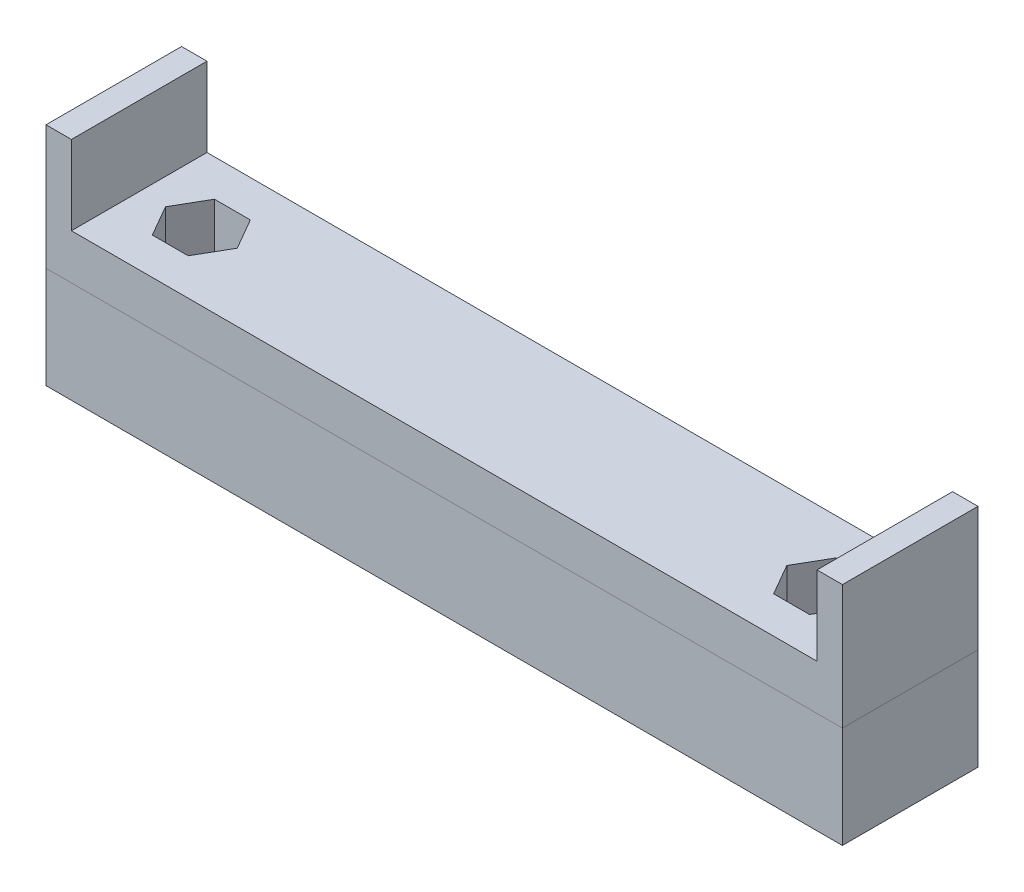
ISO-10303-21;
HEADER;
FILE_DESCRIPTION(('STEP AP214'),'2;1');
FILE_NAME('part.step','',(''),(''),'','','');
FILE_SCHEMA(('AUTOMOTIVE_DESIGN { 1 0 10303 214 1 1 1 1 }'));
ENDSEC;
DATA;
#1=APPLICATION_CONTEXT('core data for automotive mechanical design processes');
#2=APPLICATION_PROTOCOL_DEFINITION('international standard','automotive_design',2000,#1);
#3=PRODUCT_CONTEXT('',#1,'mechanical');
#4=PRODUCT('Part','Part','',(#3));
#5=PRODUCT_RELATED_PRODUCT_CATEGORY('part','',(#4));
#6=PRODUCT_DEFINITION_FORMATION('','',#4);
#7=PRODUCT_DEFINITION_CONTEXT('part definition',#1,'design');
#8=PRODUCT_DEFINITION('design','',#6,#7);
#9=PRODUCT_DEFINITION_SHAPE('','',#8);
#10=(LENGTH_UNIT() NAMED_UNIT(*) SI_UNIT(.MILLI.,.METRE.));
#11=(NAMED_UNIT(*) PLANE_ANGLE_UNIT() SI_UNIT($,.RADIAN.));
#12=(NAMED_UNIT(*) SI_UNIT($,.STERADIAN.) SOLID_ANGLE_UNIT());
#13=UNCERTAINTY_MEASURE_WITH_UNIT(LENGTH_MEASURE(1.E-05),#10,'distance_accuracy_value','');
#14=(GEOMETRIC_REPRESENTATION_CONTEXT(3) GLOBAL_UNCERTAINTY_ASSIGNED_CONTEXT((#13)) GLOBAL_UNIT_ASSIGNED_CONTEXT((#10,
#11,#12)) REPRESENTATION_CONTEXT('',''));
#15=CARTESIAN_POINT('',(0.,0.,0.));
#16=DIRECTION('',(0.,0.,1.));
#17=DIRECTION('',(1.,0.,0.));
#18=AXIS2_PLACEMENT_3D('',#15,#16,#17);
#19=CARTESIAN_POINT('',(0.,3.,0.));
#20=DIRECTION('',(0.,1.,0.));
#21=DIRECTION('',(0.,0.,1.));
#22=AXIS2_PLACEMENT_3D('',#19,#20,#21);
#23=PLANE('',#22);
#24=DIRECTION('',(0.,0.,-1.));
#25=VECTOR('',#24,1.);
#26=CARTESIAN_POINT('',(11.8285330862955,3.,15.7136970191991));
#27=LINE('',#26,#25);
#28=CARTESIAN_POINT('',(11.8285330862955,3.,15.7136970191991));
#29=VERTEX_POINT('',#28);
#30=CARTESIAN_POINT('',(11.8285330862955,3.,3.71369701919913));
#31=VERTEX_POINT('',#30);
#32=EDGE_CURVE('E315',#29,#31,#27,.T.);
#33=ORIENTED_EDGE('',*,*,#32,.F.);
#34=DIRECTION('',(1.,0.,0.));
#35=VECTOR('',#34,1.);
#36=CARTESIAN_POINT('',(12.3285330862955,3.,15.7136970191991));
#37=LINE('',#36,#35);
#38=CARTESIAN_POINT('',(77.8285330862955,3.,15.7136970191991));
#39=VERTEX_POINT('',#38);
#40=EDGE_CURVE('E46',#29,#39,#37,.T.);
#41=ORIENTED_EDGE('',*,*,#40,.T.);
#42=DIRECTION('',(0.,0.,1.));
#43=VECTOR('',#42,1.);
#44=CARTESIAN_POINT('',(77.8285330862955,3.,3.71369701919913));
#45=LINE('',#44,#43);
#46=CARTESIAN_POINT('',(77.8285330862955,3.,3.71369701919913));
#47=VERTEX_POINT('',#46);
#48=EDGE_CURVE('E328',#47,#39,#45,.T.);
#49=ORIENTED_EDGE('',*,*,#48,.F.);
#50=DIRECTION('',(-1.,0.,0.));
#51=VECTOR('',#50,1.);
#52=CARTESIAN_POINT('',(12.3285330862955,3.,3.71369701919913));
#53=LINE('',#52,#51);
#54=EDGE_CURVE('E11',#47,#31,#53,.T.);
#55=ORIENTED_EDGE('',*,*,#54,.T.);
#56=EDGE_LOOP('',(#33,#41,#49,#55));
#57=FACE_BOUND('',#56,.T.);
#58=DIRECTION('',(0.5,0.,-0.866025403784439));
#59=VECTOR('',#58,1.);
#60=CARTESIAN_POINT('',(18.9162463265669,3.,12.4636970191991));
#61=LINE('',#60,#59);
#62=CARTESIAN_POINT('',(18.9162463265669,3.,12.4636970191991));
#63=VERTEX_POINT('',#62);
#64=CARTESIAN_POINT('',(20.5039595668384,3.,9.71369701919912));
#65=VERTEX_POINT('',#64);
#66=EDGE_CURVE('E62',#63,#65,#61,.T.);
#67=ORIENTED_EDGE('',*,*,#66,.F.);
#68=DIRECTION('',(1.,0.,0.));
#69=VECTOR('',#68,1.);
#70=CARTESIAN_POINT('',(15.740819846024,3.,12.4636970191991));
#71=LINE('',#70,#69);
#72=CARTESIAN_POINT('',(15.740819846024,3.,12.4636970191991));
#73=VERTEX_POINT('',#72);
#74=EDGE_CURVE('E208',#73,#63,#71,.T.);
#75=ORIENTED_EDGE('',*,*,#74,.F.);
#76=DIRECTION('',(0.5,0.,0.866025403784438));
#77=VECTOR('',#76,1.);
#78=CARTESIAN_POINT('',(14.1531066057525,3.,9.71369701919912));
#79=LINE('',#78,#77);
#80=CARTESIAN_POINT('',(14.1531066057525,3.,9.71369701919912));
#81=VERTEX_POINT('',#80);
#82=EDGE_CURVE('E540',#81,#73,#79,.T.);
#83=ORIENTED_EDGE('',*,*,#82,.F.);
#84=DIRECTION('',(-0.5,0.,0.866025403784439));
#85=VECTOR('',#84,1.);
#86=CARTESIAN_POINT('',(15.740819846024,3.,6.96369701919912));
#87=LINE('',#86,#85);
#88=CARTESIAN_POINT('',(15.740819846024,3.,6.96369701919912));
#89=VERTEX_POINT('',#88);
#90=EDGE_CURVE('E537',#89,#81,#87,.T.);
#91=ORIENTED_EDGE('',*,*,#90,.F.);
#92=DIRECTION('',(-1.,0.,0.));
#93=VECTOR('',#92,1.);
#94=CARTESIAN_POINT('',(18.9162463265669,3.,6.96369701919912));
#95=LINE('',#94,#93);
#96=CARTESIAN_POINT('',(18.9162463265669,3.,6.96369701919912));
#97=VERTEX_POINT('',#96);
#98=EDGE_CURVE('E534',#97,#89,#95,.T.);
#99=ORIENTED_EDGE('',*,*,#98,.F.);
#100=DIRECTION('',(-0.5,0.,-0.866025403784439));
#101=VECTOR('',#100,1.);
#102=CARTESIAN_POINT('',(20.5039595668384,3.,9.71369701919912));
#103=LINE('',#102,#101);
#104=EDGE_CURVE('E532',#65,#97,#103,.T.);
#105=ORIENTED_EDGE('',*,*,#104,.F.);
#106=EDGE_LOOP('',(#67,#75,#83,#91,#99,#105));
#107=FACE_BOUND('',#106,.T.);
#108=DIRECTION('',(-0.499999999999999,0.,0.866025403784439));
#109=VECTOR('',#108,1.);
#110=CARTESIAN_POINT('',(70.740819846024,3.,6.96369701919913));
#111=LINE('',#110,#109);
#112=CARTESIAN_POINT('',(70.740819846024,3.,6.96369701919913));
#113=VERTEX_POINT('',#112);
#114=CARTESIAN_POINT('',(69.1531066057525,3.,9.71369701919911));
#115=VERTEX_POINT('',#114);
#116=EDGE_CURVE('E54',#113,#115,#111,.T.);
#117=ORIENTED_EDGE('',*,*,#116,.F.);
#118=DIRECTION('',(-1.,0.,0.));
#119=VECTOR('',#118,1.);
#120=CARTESIAN_POINT('',(73.9162463265669,3.,6.96369701919913));
#121=LINE('',#120,#119);
#122=CARTESIAN_POINT('',(73.9162463265669,3.,6.96369701919913));
#123=VERTEX_POINT('',#122);
#124=EDGE_CURVE('E516',#123,#113,#121,.T.);
#125=ORIENTED_EDGE('',*,*,#124,.F.);
#126=DIRECTION('',(-0.499999999999998,0.,-0.86602540378444));
#127=VECTOR('',#126,1.);
#128=CARTESIAN_POINT('',(75.5039595668384,3.,9.71369701919913));
#129=LINE('',#128,#127);
#130=CARTESIAN_POINT('',(75.5039595668384,3.,9.71369701919913));
#131=VERTEX_POINT('',#130);
#132=EDGE_CURVE('E513',#131,#123,#129,.T.);
#133=ORIENTED_EDGE('',*,*,#132,.F.);
#134=DIRECTION('',(0.5,0.,-0.866025403784439));
#135=VECTOR('',#134,1.);
#136=CARTESIAN_POINT('',(73.9162463265669,3.,12.4636970191991));
#137=LINE('',#136,#135);
#138=CARTESIAN_POINT('',(73.9162463265669,3.,12.4636970191991));
#139=VERTEX_POINT('',#138);
#140=EDGE_CURVE('E510',#139,#131,#137,.T.);
#141=ORIENTED_EDGE('',*,*,#140,.F.);
#142=DIRECTION('',(1.,0.,0.));
#143=VECTOR('',#142,1.);
#144=CARTESIAN_POINT('',(70.740819846024,3.,12.4636970191991));
#145=LINE('',#144,#143);
#146=CARTESIAN_POINT('',(70.740819846024,3.,12.4636970191991));
#147=VERTEX_POINT('',#146);
#148=EDGE_CURVE('E504',#147,#139,#145,.T.);
#149=ORIENTED_EDGE('',*,*,#148,.F.);
#150=DIRECTION('',(0.499999999999999,0.,0.866025403784439));
#151=VECTOR('',#150,1.);
#152=CARTESIAN_POINT('',(69.1531066057525,3.,9.71369701919912));
#153=LINE('',#152,#151);
#154=EDGE_CURVE('E501',#115,#147,#153,.T.);
#155=ORIENTED_EDGE('',*,*,#154,.F.);
#156=EDGE_LOOP('',(#117,#125,#133,#141,#149,#155));
#157=FACE_BOUND('',#156,.T.);
#158=ADVANCED_FACE('F34',(#57,#107,#157),#23,.T.);
#159=CARTESIAN_POINT('',(12.3285330862955,3.,15.7136970191991));
#160=DIRECTION('',(0.,0.,-1.));
#161=DIRECTION('',(-1.,0.,0.));
#162=AXIS2_PLACEMENT_3D('',#159,#160,#161);
#163=PLANE('',#162);
#164=ORIENTED_EDGE('',*,*,#40,.F.);
#165=DIRECTION('',(0.,-1.,0.));
#166=VECTOR('',#165,1.);
#167=CARTESIAN_POINT('',(11.8285330862955,3.,15.7136970191991));
#168=LINE('',#167,#166);
#169=CARTESIAN_POINT('',(11.8285330862955,10.,15.7136970191991));
#170=VERTEX_POINT('',#169);
#171=EDGE_CURVE('E324',#170,#29,#168,.T.);
#172=ORIENTED_EDGE('',*,*,#171,.F.);
#173=DIRECTION('',(1.,0.,0.));
#174=VECTOR('',#173,1.);
#175=CARTESIAN_POINT('',(9.57853308629547,10.,15.7136970191991));
#176=LINE('',#175,#174);
#177=CARTESIAN_POINT('',(9.57853308629547,10.,15.7136970191991));
#178=VERTEX_POINT('',#177);
#179=EDGE_CURVE('E337',#178,#170,#176,.T.);
#180=ORIENTED_EDGE('',*,*,#179,.F.);
#181=DIRECTION('',(0.,1.,0.));
#182=VECTOR('',#181,1.);
#183=CARTESIAN_POINT('',(9.57853308629547,-0.999999999999999,15.7136970191991));
#184=LINE('',#183,#182);
#185=CARTESIAN_POINT('',(9.57819845694478,-1.,15.7136970098677));
#186=VERTEX_POINT('',#185);
#187=EDGE_CURVE('E429',#186,#178,#184,.T.);
#188=ORIENTED_EDGE('',*,*,#187,.F.);
#189=CARTESIAN_POINT('',(80.0778638275941,-1.,15.7176288954131));
#190=DIRECTION('',(-0.999999998444767,0.,-5.57715584490854E-05));
#191=VECTOR('',#190,1.);
#192=LINE('',#189,#191);
#193=CARTESIAN_POINT('',(80.0781984569448,-1.,15.7156629573061));
#194=VERTEX_POINT('',#193);
#195=EDGE_CURVE('E425',#194,#186,#192,.T.);
#196=ORIENTED_EDGE('',*,*,#195,.F.);
#197=DIRECTION('',(0.,-1.,0.));
#198=VECTOR('',#197,1.);
#199=CARTESIAN_POINT('',(80.0785330862955,-1.,15.7136970191991));
#200=LINE('',#199,#198);
#201=CARTESIAN_POINT('',(80.0785330862955,10.,15.7136970191991));
#202=VERTEX_POINT('',#201);
#203=EDGE_CURVE('E402',#202,#194,#200,.T.);
#204=ORIENTED_EDGE('',*,*,#203,.F.);
#205=DIRECTION('',(1.,0.,0.));
#206=VECTOR('',#205,1.);
#207=CARTESIAN_POINT('',(78.0785330862955,10.,15.7136970191991));
#208=LINE('',#207,#206);
#209=CARTESIAN_POINT('',(77.8285330862955,10.,15.7136970191991));
#210=VERTEX_POINT('',#209);
#211=EDGE_CURVE('E348',#210,#202,#208,.T.);
#212=ORIENTED_EDGE('',*,*,#211,.F.);
#213=DIRECTION('',(0.,1.,0.));
#214=VECTOR('',#213,1.);
#215=CARTESIAN_POINT('',(77.8285330862955,3.,15.7136970191991));
#216=LINE('',#215,#214);
#217=EDGE_CURVE('E331',#39,#210,#216,.T.);
#218=ORIENTED_EDGE('',*,*,#217,.F.);
#219=EDGE_LOOP('',(#164,#172,#180,#188,#196,#204,#212,#218));
#220=FACE_BOUND('',#219,.T.);
#221=ADVANCED_FACE('F36',(#220),#163,.F.);
#222=CARTESIAN_POINT('',(12.3285330862955,3.,3.71369701919913));
#223=DIRECTION('',(0.,0.,1.));
#224=DIRECTION('',(1.,0.,0.));
#225=AXIS2_PLACEMENT_3D('',#222,#223,#224);
#226=PLANE('',#225);
#227=ORIENTED_EDGE('',*,*,#54,.F.);
#228=DIRECTION('',(0.,-1.,0.));
#229=VECTOR('',#228,1.);
#230=CARTESIAN_POINT('',(77.8285330862955,3.,3.71369701919913));
#231=LINE('',#230,#229);
#232=CARTESIAN_POINT('',(77.8285330862955,10.,3.71369701919912));
#233=VERTEX_POINT('',#232);
#234=EDGE_CURVE('E326',#233,#47,#231,.T.);
#235=ORIENTED_EDGE('',*,*,#234,.F.);
#236=DIRECTION('',(-1.,0.,0.));
#237=VECTOR('',#236,1.);
#238=CARTESIAN_POINT('',(78.0785330862955,10.,3.71369701919912));
#239=LINE('',#238,#237);
#240=CARTESIAN_POINT('',(80.0785330862955,10.,3.71369701919912));
#241=VERTEX_POINT('',#240);
#242=EDGE_CURVE('E346',#241,#233,#239,.T.);
#243=ORIENTED_EDGE('',*,*,#242,.F.);
#244=DIRECTION('',(0.,-1.,0.));
#245=VECTOR('',#244,1.);
#246=CARTESIAN_POINT('',(80.0785330862955,10.,3.71369701919912));
#247=LINE('',#246,#245);
#248=CARTESIAN_POINT('',(80.0785330862955,8.,3.71369701919912));
#249=VERTEX_POINT('',#248);
#250=EDGE_CURVE('E354',#241,#249,#247,.T.);
#251=ORIENTED_EDGE('',*,*,#250,.T.);
#252=DIRECTION('',(-1.,0.,0.));
#253=VECTOR('',#252,1.);
#254=CARTESIAN_POINT('',(78.0785330862955,8.,3.71369701919912));
#255=LINE('',#254,#253);
#256=CARTESIAN_POINT('',(79.3285330862955,8.,3.71467999291832));
#257=VERTEX_POINT('',#256);
#258=EDGE_CURVE('E345',#249,#257,#255,.T.);
#259=ORIENTED_EDGE('',*,*,#258,.T.);
#260=CARTESIAN_POINT('',(79.3285330862955,-1.,3.7176289140759));
#261=DIRECTION('',(0.,1.,0.));
#262=VECTOR('',#261,1.);
#263=LINE('',#260,#262);
#264=CARTESIAN_POINT('',(79.3285330874619,-1.,3.71662502602233));
#265=VERTEX_POINT('',#264);
#266=EDGE_CURVE('E365',#265,#257,#263,.T.);
#267=ORIENTED_EDGE('',*,*,#266,.F.);
#268=CARTESIAN_POINT('',(9.57853308629547,-1.,3.71369701919913));
#269=DIRECTION('',(0.999999998444767,0.,5.57715584491107E-05));
#270=VECTOR('',#269,1.);
#271=LINE('',#268,#270);
#272=CARTESIAN_POINT('',(9.57853308629547,-1.,3.71369701919913));
#273=VERTEX_POINT('',#272);
#274=EDGE_CURVE('E268',#273,#265,#271,.T.);
#275=ORIENTED_EDGE('',*,*,#274,.F.);
#276=DIRECTION('',(0.,-1.,0.));
#277=VECTOR('',#276,1.);
#278=CARTESIAN_POINT('',(9.57853308629547,-1.,3.71369701919913));
#279=LINE('',#278,#277);
#280=CARTESIAN_POINT('',(9.57853308629547,10.,3.71369701919913));
#281=VERTEX_POINT('',#280);
#282=EDGE_CURVE('E436',#281,#273,#279,.T.);
#283=ORIENTED_EDGE('',*,*,#282,.F.);
#284=DIRECTION('',(-1.,0.,0.));
#285=VECTOR('',#284,1.);
#286=CARTESIAN_POINT('',(9.57853308629547,10.,3.71369701919913));
#287=LINE('',#286,#285);
#288=CARTESIAN_POINT('',(11.8285330862955,10.,3.71369701919913));
#289=VERTEX_POINT('',#288);
#290=EDGE_CURVE('E339',#289,#281,#287,.T.);
#291=ORIENTED_EDGE('',*,*,#290,.F.);
#292=DIRECTION('',(0.,1.,0.));
#293=VECTOR('',#292,1.);
#294=CARTESIAN_POINT('',(11.8285330862955,3.,3.71369701919913));
#295=LINE('',#294,#293);
#296=EDGE_CURVE('E318',#31,#289,#295,.T.);
#297=ORIENTED_EDGE('',*,*,#296,.F.);
#298=EDGE_LOOP('',(#227,#235,#243,#251,#259,#267,#275,#283,#291,#297));
#299=FACE_BOUND('',#298,.T.);
#300=ADVANCED_FACE('F451',(#299),#226,.F.);
#301=CARTESIAN_POINT('',(18.9162463265669,0.5,12.4636970191991));
#302=DIRECTION('',(0.866025403784439,0.,0.5));
#303=DIRECTION('',(0.5,0.,-0.866025403784439));
#304=AXIS2_PLACEMENT_3D('',#301,#302,#303);
#305=PLANE('',#304);
#306=ORIENTED_EDGE('',*,*,#66,.T.);
#307=DIRECTION('',(0.,1.,0.));
#308=VECTOR('',#307,1.);
#309=CARTESIAN_POINT('',(20.5039595668384,0.5,9.71369701919912));
#310=LINE('',#309,#308);
#311=CARTESIAN_POINT('',(20.5039595668384,-7.5,9.71369701919912));
#312=VERTEX_POINT('',#311);
#313=EDGE_CURVE('E198',#312,#65,#310,.T.);
#314=ORIENTED_EDGE('',*,*,#313,.F.);
#315=DIRECTION('',(0.499999999999996,0.,-0.866025403784441));
#316=VECTOR('',#315,1.);
#317=CARTESIAN_POINT('',(18.916246326567,-7.5,12.4636970191991));
#318=LINE('',#317,#316);
#319=CARTESIAN_POINT('',(18.916246326567,-7.5,12.4636970191991));
#320=VERTEX_POINT('',#319);
#321=EDGE_CURVE('E202',#320,#312,#318,.T.);
#322=ORIENTED_EDGE('',*,*,#321,.F.);
#323=DIRECTION('',(0.,1.,0.));
#324=VECTOR('',#323,1.);
#325=CARTESIAN_POINT('',(18.9162463265669,0.5,12.4636970191991));
#326=LINE('',#325,#324);
#327=EDGE_CURVE('E545',#320,#63,#326,.T.);
#328=ORIENTED_EDGE('',*,*,#327,.T.);
#329=EDGE_LOOP('',(#306,#314,#322,#328));
#330=FACE_BOUND('',#329,.T.);
#331=ADVANCED_FACE('F200',(#330),#305,.F.);
#332=CARTESIAN_POINT('',(15.740819846024,0.5,12.4636970191991));
#333=DIRECTION('',(0.,0.,1.));
#334=DIRECTION('',(1.,0.,0.));
#335=AXIS2_PLACEMENT_3D('',#332,#333,#334);
#336=PLANE('',#335);
#337=ORIENTED_EDGE('',*,*,#74,.T.);
#338=ORIENTED_EDGE('',*,*,#327,.F.);
#339=DIRECTION('',(1.,0.,0.));
#340=VECTOR('',#339,1.);
#341=CARTESIAN_POINT('',(15.740819846024,-7.5,12.4636970191991));
#342=LINE('',#341,#340);
#343=CARTESIAN_POINT('',(15.740819846024,-7.5,12.4636970191991));
#344=VERTEX_POINT('',#343);
#345=EDGE_CURVE('E221',#344,#320,#342,.T.);
#346=ORIENTED_EDGE('',*,*,#345,.F.);
#347=DIRECTION('',(0.,1.,0.));
#348=VECTOR('',#347,1.);
#349=CARTESIAN_POINT('',(15.740819846024,0.5,12.4636970191991));
#350=LINE('',#349,#348);
#351=EDGE_CURVE('E547',#344,#73,#350,.T.);
#352=ORIENTED_EDGE('',*,*,#351,.T.);
#353=EDGE_LOOP('',(#337,#338,#346,#352));
#354=FACE_BOUND('',#353,.T.);
#355=ADVANCED_FACE('F566',(#354),#336,.F.);
#356=CARTESIAN_POINT('',(14.1531066057525,0.5,9.71369701919912));
#357=DIRECTION('',(-0.866025403784438,0.,0.5));
#358=DIRECTION('',(0.5,0.,0.866025403784438));
#359=AXIS2_PLACEMENT_3D('',#356,#357,#358);
#360=PLANE('',#359);
#361=ORIENTED_EDGE('',*,*,#82,.T.);
#362=ORIENTED_EDGE('',*,*,#351,.F.);
#363=DIRECTION('',(0.500000000000006,0.,0.866025403784435));
#364=VECTOR('',#363,1.);
#365=CARTESIAN_POINT('',(14.1531066057525,-7.5,9.71369701919914));
#366=LINE('',#365,#364);
#367=CARTESIAN_POINT('',(14.1531066057525,-7.5,9.71369701919914));
#368=VERTEX_POINT('',#367);
#369=EDGE_CURVE('E233',#368,#344,#366,.T.);
#370=ORIENTED_EDGE('',*,*,#369,.F.);
#371=DIRECTION('',(0.,1.,0.));
#372=VECTOR('',#371,1.);
#373=CARTESIAN_POINT('',(14.1531066057525,0.5,9.71369701919912));
#374=LINE('',#373,#372);
#375=EDGE_CURVE('E549',#368,#81,#374,.T.);
#376=ORIENTED_EDGE('',*,*,#375,.T.);
#377=EDGE_LOOP('',(#361,#362,#370,#376));
#378=FACE_BOUND('',#377,.T.);
#379=ADVANCED_FACE('F567',(#378),#360,.F.);
#380=CARTESIAN_POINT('',(15.740819846024,0.5,6.96369701919912));
#381=DIRECTION('',(-0.866025403784438,0.,-0.5));
#382=DIRECTION('',(-0.5,0.,0.866025403784439));
#383=AXIS2_PLACEMENT_3D('',#380,#381,#382);
#384=PLANE('',#383);
#385=ORIENTED_EDGE('',*,*,#90,.T.);
#386=ORIENTED_EDGE('',*,*,#375,.F.);
#387=DIRECTION('',(-0.499999999999996,0.,0.866025403784441));
#388=VECTOR('',#387,1.);
#389=CARTESIAN_POINT('',(15.740819846024,-7.5,6.96369701919911));
#390=LINE('',#389,#388);
#391=CARTESIAN_POINT('',(15.740819846024,-7.5,6.96369701919911));
#392=VERTEX_POINT('',#391);
#393=EDGE_CURVE('E230',#392,#368,#390,.T.);
#394=ORIENTED_EDGE('',*,*,#393,.F.);
#395=DIRECTION('',(0.,1.,0.));
#396=VECTOR('',#395,1.);
#397=CARTESIAN_POINT('',(15.740819846024,0.5,6.96369701919912));
#398=LINE('',#397,#396);
#399=EDGE_CURVE('E551',#392,#89,#398,.T.);
#400=ORIENTED_EDGE('',*,*,#399,.T.);
#401=EDGE_LOOP('',(#385,#386,#394,#400));
#402=FACE_BOUND('',#401,.T.);
#403=ADVANCED_FACE('F561',(#402),#384,.F.);
#404=CARTESIAN_POINT('',(18.9162463265669,0.5,6.96369701919912));
#405=DIRECTION('',(0.,0.,-1.));
#406=DIRECTION('',(-1.,0.,0.));
#407=AXIS2_PLACEMENT_3D('',#404,#405,#406);
#408=PLANE('',#407);
#409=ORIENTED_EDGE('',*,*,#98,.T.);
#410=ORIENTED_EDGE('',*,*,#399,.F.);
#411=DIRECTION('',(-1.,0.,0.));
#412=VECTOR('',#411,1.);
#413=CARTESIAN_POINT('',(18.9162463265669,-7.5,6.9636970191991));
#414=LINE('',#413,#412);
#415=CARTESIAN_POINT('',(18.9162463265669,-7.5,6.9636970191991));
#416=VERTEX_POINT('',#415);
#417=EDGE_CURVE('E216',#416,#392,#414,.T.);
#418=ORIENTED_EDGE('',*,*,#417,.F.);
#419=DIRECTION('',(0.,1.,0.));
#420=VECTOR('',#419,1.);
#421=CARTESIAN_POINT('',(18.9162463265669,0.5,6.96369701919912));
#422=LINE('',#421,#420);
#423=EDGE_CURVE('E207',#416,#97,#422,.T.);
#424=ORIENTED_EDGE('',*,*,#423,.T.);
#425=EDGE_LOOP('',(#409,#410,#418,#424));
#426=FACE_BOUND('',#425,.T.);
#427=ADVANCED_FACE('F554',(#426),#408,.F.);
#428=CARTESIAN_POINT('',(20.5039595668384,0.5,9.71369701919912));
#429=DIRECTION('',(0.866025403784438,0.,-0.5));
#430=DIRECTION('',(-0.5,0.,-0.866025403784439));
#431=AXIS2_PLACEMENT_3D('',#428,#429,#430);
#432=PLANE('',#431);
#433=ORIENTED_EDGE('',*,*,#104,.T.);
#434=ORIENTED_EDGE('',*,*,#423,.F.);
#435=DIRECTION('',(-0.5,0.,-0.866025403784439));
#436=VECTOR('',#435,1.);
#437=CARTESIAN_POINT('',(20.5039595668384,-7.5,9.71369701919912));
#438=LINE('',#437,#436);
#439=EDGE_CURVE('E211',#312,#416,#438,.T.);
#440=ORIENTED_EDGE('',*,*,#439,.F.);
#441=ORIENTED_EDGE('',*,*,#313,.T.);
#442=EDGE_LOOP('',(#433,#434,#440,#441));
#443=FACE_BOUND('',#442,.T.);
#444=ADVANCED_FACE('F212',(#443),#432,.F.);
#445=CARTESIAN_POINT('',(70.740819846024,0.5,6.96369701919913));
#446=DIRECTION('',(-0.866025403784439,0.,-0.499999999999999));
#447=DIRECTION('',(-0.499999999999999,0.,0.866025403784439));
#448=AXIS2_PLACEMENT_3D('',#445,#446,#447);
#449=PLANE('',#448);
#450=ORIENTED_EDGE('',*,*,#116,.T.);
#451=DIRECTION('',(0.,1.,0.));
#452=VECTOR('',#451,1.);
#453=CARTESIAN_POINT('',(69.1531066057525,0.5,9.71369701919912));
#454=LINE('',#453,#452);
#455=CARTESIAN_POINT('',(69.1531066057525,-7.5,9.71369701919916));
#456=VERTEX_POINT('',#455);
#457=EDGE_CURVE('E519',#456,#115,#454,.T.);
#458=ORIENTED_EDGE('',*,*,#457,.F.);
#459=DIRECTION('',(-0.499999999999993,0.,0.866025403784443));
#460=VECTOR('',#459,1.);
#461=CARTESIAN_POINT('',(70.740819846024,-7.5,6.96369701919915));
#462=LINE('',#461,#460);
#463=CARTESIAN_POINT('',(70.740819846024,-7.5,6.96369701919915));
#464=VERTEX_POINT('',#463);
#465=EDGE_CURVE('E245',#464,#456,#462,.T.);
#466=ORIENTED_EDGE('',*,*,#465,.F.);
#467=DIRECTION('',(0.,1.,0.));
#468=VECTOR('',#467,1.);
#469=CARTESIAN_POINT('',(70.740819846024,0.5,6.96369701919913));
#470=LINE('',#469,#468);
#471=EDGE_CURVE('E520',#464,#113,#470,.T.);
#472=ORIENTED_EDGE('',*,*,#471,.T.);
#473=EDGE_LOOP('',(#450,#458,#466,#472));
#474=FACE_BOUND('',#473,.T.);
#475=ADVANCED_FACE('F629',(#474),#449,.F.);
#476=CARTESIAN_POINT('',(73.9162463265669,0.5,6.96369701919913));
#477=DIRECTION('',(0.,0.,-1.));
#478=DIRECTION('',(-1.,0.,0.));
#479=AXIS2_PLACEMENT_3D('',#476,#477,#478);
#480=PLANE('',#479);
#481=ORIENTED_EDGE('',*,*,#124,.T.);
#482=ORIENTED_EDGE('',*,*,#471,.F.);
#483=DIRECTION('',(-1.,0.,0.));
#484=VECTOR('',#483,1.);
#485=CARTESIAN_POINT('',(73.9162463265669,-7.5,6.96369701919913));
#486=LINE('',#485,#484);
#487=CARTESIAN_POINT('',(73.9162463265669,-7.5,6.96369701919913));
#488=VERTEX_POINT('',#487);
#489=EDGE_CURVE('E242',#488,#464,#486,.T.);
#490=ORIENTED_EDGE('',*,*,#489,.F.);
#491=DIRECTION('',(0.,1.,0.));
#492=VECTOR('',#491,1.);
#493=CARTESIAN_POINT('',(73.9162463265669,0.5,6.96369701919913));
#494=LINE('',#493,#492);
#495=EDGE_CURVE('E522',#488,#123,#494,.T.);
#496=ORIENTED_EDGE('',*,*,#495,.T.);
#497=EDGE_LOOP('',(#481,#482,#490,#496));
#498=FACE_BOUND('',#497,.T.);
#499=ADVANCED_FACE('F751',(#498),#480,.F.);
#500=CARTESIAN_POINT('',(75.5039595668384,0.5,9.71369701919913));
#501=DIRECTION('',(0.86602540378444,0.,-0.499999999999998));
#502=DIRECTION('',(-0.499999999999998,0.,-0.86602540378444));
#503=AXIS2_PLACEMENT_3D('',#500,#501,#502);
#504=PLANE('',#503);
#505=ORIENTED_EDGE('',*,*,#132,.T.);
#506=ORIENTED_EDGE('',*,*,#495,.F.);
#507=DIRECTION('',(-0.500000000000002,0.,-0.866025403784438));
#508=VECTOR('',#507,1.);
#509=CARTESIAN_POINT('',(75.5039595668384,-7.5,9.71369701919913));
#510=LINE('',#509,#508);
#511=CARTESIAN_POINT('',(75.5039595668384,-7.5,9.71369701919913));
#512=VERTEX_POINT('',#511);
#513=EDGE_CURVE('E239',#512,#488,#510,.T.);
#514=ORIENTED_EDGE('',*,*,#513,.F.);
#515=DIRECTION('',(0.,1.,0.));
#516=VECTOR('',#515,1.);
#517=CARTESIAN_POINT('',(75.5039595668384,0.5,9.71369701919913));
#518=LINE('',#517,#516);
#519=EDGE_CURVE('E524',#512,#131,#518,.T.);
#520=ORIENTED_EDGE('',*,*,#519,.T.);
#521=EDGE_LOOP('',(#505,#506,#514,#520));
#522=FACE_BOUND('',#521,.T.);
#523=ADVANCED_FACE('F761',(#522),#504,.F.);
#524=CARTESIAN_POINT('',(73.9162463265669,0.5,12.4636970191991));
#525=DIRECTION('',(0.866025403784439,0.,0.5));
#526=DIRECTION('',(0.5,0.,-0.866025403784439));
#527=AXIS2_PLACEMENT_3D('',#524,#525,#526);
#528=PLANE('',#527);
#529=ORIENTED_EDGE('',*,*,#140,.T.);
#530=ORIENTED_EDGE('',*,*,#519,.F.);
#531=DIRECTION('',(0.499999999999994,0.,-0.866025403784442));
#532=VECTOR('',#531,1.);
#533=CARTESIAN_POINT('',(73.916246326567,-7.5,12.4636970191991));
#534=LINE('',#533,#532);
#535=CARTESIAN_POINT('',(73.916246326567,-7.5,12.4636970191991));
#536=VERTEX_POINT('',#535);
#537=EDGE_CURVE('E236',#536,#512,#534,.T.);
#538=ORIENTED_EDGE('',*,*,#537,.F.);
#539=DIRECTION('',(0.,1.,0.));
#540=VECTOR('',#539,1.);
#541=CARTESIAN_POINT('',(73.9162463265669,0.5,12.4636970191991));
#542=LINE('',#541,#540);
#543=EDGE_CURVE('E526',#536,#139,#542,.T.);
#544=ORIENTED_EDGE('',*,*,#543,.T.);
#545=EDGE_LOOP('',(#529,#530,#538,#544));
#546=FACE_BOUND('',#545,.T.);
#547=ADVANCED_FACE('F771',(#546),#528,.F.);
#548=CARTESIAN_POINT('',(70.740819846024,0.5,12.4636970191991));
#549=DIRECTION('',(0.,0.,1.));
#550=DIRECTION('',(1.,0.,0.));
#551=AXIS2_PLACEMENT_3D('',#548,#549,#550);
#552=PLANE('',#551);
#553=ORIENTED_EDGE('',*,*,#148,.T.);
#554=ORIENTED_EDGE('',*,*,#543,.F.);
#555=DIRECTION('',(1.,0.,0.));
#556=VECTOR('',#555,1.);
#557=CARTESIAN_POINT('',(70.740819846024,-7.5,12.4636970191991));
#558=LINE('',#557,#556);
#559=CARTESIAN_POINT('',(70.740819846024,-7.5,12.4636970191991));
#560=VERTEX_POINT('',#559);
#561=EDGE_CURVE('E251',#560,#536,#558,.T.);
#562=ORIENTED_EDGE('',*,*,#561,.F.);
#563=DIRECTION('',(0.,1.,0.));
#564=VECTOR('',#563,1.);
#565=CARTESIAN_POINT('',(70.740819846024,0.5,12.4636970191991));
#566=LINE('',#565,#564);
#567=EDGE_CURVE('E528',#560,#147,#566,.T.);
#568=ORIENTED_EDGE('',*,*,#567,.T.);
#569=EDGE_LOOP('',(#553,#554,#562,#568));
#570=FACE_BOUND('',#569,.T.);
#571=ADVANCED_FACE('F782',(#570),#552,.F.);
#572=CARTESIAN_POINT('',(69.1531066057525,0.5,9.71369701919912));
#573=DIRECTION('',(-0.866025403784439,0.,0.499999999999999));
#574=DIRECTION('',(0.499999999999999,0.,0.866025403784439));
#575=AXIS2_PLACEMENT_3D('',#572,#573,#574);
#576=PLANE('',#575);
#577=ORIENTED_EDGE('',*,*,#154,.T.);
#578=ORIENTED_EDGE('',*,*,#567,.F.);
#579=DIRECTION('',(0.50000000000001,0.,0.866025403784433));
#580=VECTOR('',#579,1.);
#581=CARTESIAN_POINT('',(69.1531066057525,-7.5,9.71369701919916));
#582=LINE('',#581,#580);
#583=EDGE_CURVE('E248',#456,#560,#582,.T.);
#584=ORIENTED_EDGE('',*,*,#583,.F.);
#585=ORIENTED_EDGE('',*,*,#457,.T.);
#586=EDGE_LOOP('',(#577,#578,#584,#585));
#587=FACE_BOUND('',#586,.T.);
#588=ADVANCED_FACE('F792',(#587),#576,.F.);
#589=CARTESIAN_POINT('',(9.57853308629547,0.,0.));
#590=DIRECTION('',(-1.,0.,0.));
#591=DIRECTION('',(0.,0.,1.));
#592=AXIS2_PLACEMENT_3D('',#589,#590,#591);
#593=PLANE('',#592);
#594=CARTESIAN_POINT('',(9.57853308629547,-1.,3.71369701919913));
#595=DIRECTION('',(0.,0.,1.));
#596=VECTOR('',#595,1.);
#597=LINE('',#594,#596);
#598=EDGE_CURVE('E437',#273,#186,#597,.T.);
#599=ORIENTED_EDGE('',*,*,#598,.T.);
#600=ORIENTED_EDGE('',*,*,#187,.T.);
#601=DIRECTION('',(0.,0.,1.));
#602=VECTOR('',#601,1.);
#603=CARTESIAN_POINT('',(9.57853308629547,10.,15.7136970191991));
#604=LINE('',#603,#602);
#605=EDGE_CURVE('E342',#281,#178,#604,.T.);
#606=ORIENTED_EDGE('',*,*,#605,.F.);
#607=ORIENTED_EDGE('',*,*,#282,.T.);
#608=EDGE_LOOP('',(#599,#600,#606,#607));
#609=FACE_BOUND('',#608,.T.);
#610=ADVANCED_FACE('F382',(#609),#593,.T.);
#611=CARTESIAN_POINT('',(80.0785330862955,-1.,3.7176289140759));
#612=DIRECTION('',(0.,0.,1.));
#613=DIRECTION('',(0.,-1.,0.));
#614=AXIS2_PLACEMENT_3D('',#611,#612,#613);
#615=PLANE('',#614);
#616=ORIENTED_EDGE('',*,*,#266,.T.);
#617=DIRECTION('',(-1.,0.,0.));
#618=VECTOR('',#617,1.);
#619=CARTESIAN_POINT('',(80.0785330862955,7.99999999999999,3.7176289140759));
#620=LINE('',#619,#618);
#621=CARTESIAN_POINT('',(80.0785330862955,8.,3.7176289140759));
#622=VERTEX_POINT('',#621);
#623=EDGE_CURVE('E370',#622,#257,#620,.T.);
#624=ORIENTED_EDGE('',*,*,#623,.F.);
#625=DIRECTION('',(0.,1.,0.));
#626=VECTOR('',#625,1.);
#627=CARTESIAN_POINT('',(80.0785330862955,-1.,3.7176289140759));
#628=LINE('',#627,#626);
#629=CARTESIAN_POINT('',(80.0785330862955,-1.,3.7176289140759));
#630=VERTEX_POINT('',#629);
#631=EDGE_CURVE('E394',#630,#622,#628,.T.);
#632=ORIENTED_EDGE('',*,*,#631,.F.);
#633=CARTESIAN_POINT('',(80.0785330862955,-1.,3.7176289140759));
#634=DIRECTION('',(-1.,0.,0.));
#635=VECTOR('',#634,1.);
#636=LINE('',#633,#635);
#637=EDGE_CURVE('E313',#630,#265,#636,.T.);
#638=ORIENTED_EDGE('',*,*,#637,.T.);
#639=EDGE_LOOP('',(#616,#624,#632,#638));
#640=FACE_BOUND('',#639,.T.);
#641=ADVANCED_FACE('F372',(#640),#615,.F.);
#642=CARTESIAN_POINT('',(80.0785330862955,0.,0.));
#643=DIRECTION('',(1.,0.,0.));
#644=DIRECTION('',(0.,0.,-1.));
#645=AXIS2_PLACEMENT_3D('',#642,#643,#644);
#646=PLANE('',#645);
#647=CARTESIAN_POINT('',(80.0785330862955,-1.,15.7136970191991));
#648=DIRECTION('',(0.,0.,-1.));
#649=VECTOR('',#648,1.);
#650=LINE('',#647,#649);
#651=EDGE_CURVE('E403',#194,#630,#650,.T.);
#652=ORIENTED_EDGE('',*,*,#651,.T.);
#653=ORIENTED_EDGE('',*,*,#631,.T.);
#654=DIRECTION('',(0.,0.,-1.));
#655=VECTOR('',#654,1.);
#656=CARTESIAN_POINT('',(80.0785330862955,8.,3.71369701919912));
#657=LINE('',#656,#655);
#658=EDGE_CURVE('E349',#622,#249,#657,.T.);
#659=ORIENTED_EDGE('',*,*,#658,.T.);
#660=ORIENTED_EDGE('',*,*,#250,.F.);
#661=DIRECTION('',(0.,0.,-1.));
#662=VECTOR('',#661,1.);
#663=CARTESIAN_POINT('',(80.0785330862955,10.,3.71369701919912));
#664=LINE('',#663,#662);
#665=EDGE_CURVE('E352',#202,#241,#664,.T.);
#666=ORIENTED_EDGE('',*,*,#665,.F.);
#667=ORIENTED_EDGE('',*,*,#203,.T.);
#668=EDGE_LOOP('',(#652,#653,#659,#660,#666,#667));
#669=FACE_BOUND('',#668,.T.);
#670=ADVANCED_FACE('F381',(#669),#646,.T.);
#671=CARTESIAN_POINT('',(0.,8.,0.));
#672=DIRECTION('',(0.,-1.,0.));
#673=DIRECTION('',(0.,0.,-1.));
#674=AXIS2_PLACEMENT_3D('',#671,#672,#673);
#675=PLANE('',#674);
#676=ORIENTED_EDGE('',*,*,#623,.T.);
#677=ORIENTED_EDGE('',*,*,#258,.F.);
#678=ORIENTED_EDGE('',*,*,#658,.F.);
#679=EDGE_LOOP('',(#676,#677,#678));
#680=FACE_BOUND('',#679,.T.);
#681=ADVANCED_FACE('F447',(#680),#675,.T.);
#682=CARTESIAN_POINT('',(0.,10.,0.));
#683=DIRECTION('',(0.,-1.,0.));
#684=DIRECTION('',(0.,0.,-1.));
#685=AXIS2_PLACEMENT_3D('',#682,#683,#684);
#686=PLANE('',#685);
#687=ORIENTED_EDGE('',*,*,#242,.T.);
#688=DIRECTION('',(0.,0.,-1.));
#689=VECTOR('',#688,1.);
#690=CARTESIAN_POINT('',(77.8285330862955,10.,3.71369701919912));
#691=LINE('',#690,#689);
#692=EDGE_CURVE('E334',#210,#233,#691,.T.);
#693=ORIENTED_EDGE('',*,*,#692,.F.);
#694=ORIENTED_EDGE('',*,*,#211,.T.);
#695=ORIENTED_EDGE('',*,*,#665,.T.);
#696=EDGE_LOOP('',(#687,#693,#694,#695));
#697=FACE_BOUND('',#696,.T.);
#698=ADVANCED_FACE('F458',(#697),#686,.F.);
#699=CARTESIAN_POINT('',(0.,10.,0.));
#700=DIRECTION('',(0.,1.,0.));
#701=DIRECTION('',(0.,0.,1.));
#702=AXIS2_PLACEMENT_3D('',#699,#700,#701);
#703=PLANE('',#702);
#704=ORIENTED_EDGE('',*,*,#179,.T.);
#705=DIRECTION('',(0.,0.,1.));
#706=VECTOR('',#705,1.);
#707=CARTESIAN_POINT('',(11.8285330862955,10.,15.7136970191991));
#708=LINE('',#707,#706);
#709=EDGE_CURVE('E321',#289,#170,#708,.T.);
#710=ORIENTED_EDGE('',*,*,#709,.F.);
#711=ORIENTED_EDGE('',*,*,#290,.T.);
#712=ORIENTED_EDGE('',*,*,#605,.T.);
#713=EDGE_LOOP('',(#704,#710,#711,#712));
#714=FACE_BOUND('',#713,.T.);
#715=ADVANCED_FACE('F829',(#714),#703,.T.);
#716=CARTESIAN_POINT('',(77.8285330862955,0.,0.));
#717=DIRECTION('',(1.,0.,0.));
#718=DIRECTION('',(0.,0.,-1.));
#719=AXIS2_PLACEMENT_3D('',#716,#717,#718);
#720=PLANE('',#719);
#721=ORIENTED_EDGE('',*,*,#234,.T.);
#722=ORIENTED_EDGE('',*,*,#48,.T.);
#723=ORIENTED_EDGE('',*,*,#217,.T.);
#724=ORIENTED_EDGE('',*,*,#692,.T.);
#725=EDGE_LOOP('',(#721,#722,#723,#724));
#726=FACE_BOUND('',#725,.T.);
#727=ADVANCED_FACE('F463',(#726),#720,.F.);
#728=CARTESIAN_POINT('',(11.8285330862955,0.,0.));
#729=DIRECTION('',(1.,0.,0.));
#730=DIRECTION('',(0.,0.,-1.));
#731=AXIS2_PLACEMENT_3D('',#728,#729,#730);
#732=PLANE('',#731);
#733=ORIENTED_EDGE('',*,*,#32,.T.);
#734=ORIENTED_EDGE('',*,*,#296,.T.);
#735=ORIENTED_EDGE('',*,*,#709,.T.);
#736=ORIENTED_EDGE('',*,*,#171,.T.);
#737=EDGE_LOOP('',(#733,#734,#735,#736));
#738=FACE_BOUND('',#737,.T.);
#739=ADVANCED_FACE('F296',(#738),#732,.T.);
#740=CARTESIAN_POINT('',(0.,-10.,0.));
#741=DIRECTION('',(0.,1.,0.));
#742=DIRECTION('',(0.,0.,1.));
#743=AXIS2_PLACEMENT_3D('',#740,#741,#742);
#744=PLANE('',#743);
#745=CARTESIAN_POINT('',(72.3285330862955,-10.,9.71369701919914));
#746=DIRECTION('',(0.,1.,0.));
#747=DIRECTION('',(0.,0.,1.));
#748=AXIS2_PLACEMENT_3D('',#745,#746,#747);
#749=CIRCLE('',#748,1.5);
#750=CARTESIAN_POINT('',(72.3285330862955,-10.,11.2136970191991));
#751=VERTEX_POINT('',#750);
#752=EDGE_CURVE('E998',#751,#751,#749,.T.);
#753=ORIENTED_EDGE('',*,*,#752,.T.);
#754=EDGE_LOOP('',(#753));
#755=FACE_BOUND('',#754,.T.);
#756=CARTESIAN_POINT('',(17.3285330862955,-10.,9.71369701919914));
#757=DIRECTION('',(0.,1.,0.));
#758=DIRECTION('',(0.,0.,1.));
#759=AXIS2_PLACEMENT_3D('',#756,#757,#758);
#760=CIRCLE('',#759,1.5);
#761=CARTESIAN_POINT('',(17.3285330862955,-10.,11.2136970191991));
#762=VERTEX_POINT('',#761);
#763=EDGE_CURVE('E222',#762,#762,#760,.T.);
#764=ORIENTED_EDGE('',*,*,#763,.T.);
#765=EDGE_LOOP('',(#764));
#766=FACE_BOUND('',#765,.T.);
#767=DIRECTION('',(5.57715584493269E-05,0.,-0.999999998444767));
#768=VECTOR('',#767,1.);
#769=CARTESIAN_POINT('',(9.57853308629547,-10.,3.71369701919913));
#770=LINE('',#769,#768);
#771=CARTESIAN_POINT('',(9.57786382759408,-10.,15.7136970005363));
#772=VERTEX_POINT('',#771);
#773=CARTESIAN_POINT('',(9.57853308629547,-10.,3.71369701919913));
#774=VERTEX_POINT('',#773);
#775=EDGE_CURVE('E254',#772,#774,#770,.T.);
#776=ORIENTED_EDGE('',*,*,#775,.T.);
#777=DIRECTION('',(0.999999998444767,0.,5.577155844911E-05));
#778=VECTOR('',#777,1.);
#779=CARTESIAN_POINT('',(9.57853308629547,-10.,3.71369701919913));
#780=LINE('',#779,#778);
#781=CARTESIAN_POINT('',(80.0785330862955,-10.,3.7176289140759));
#782=VERTEX_POINT('',#781);
#783=EDGE_CURVE('E257',#774,#782,#780,.T.);
#784=ORIENTED_EDGE('',*,*,#783,.T.);
#785=DIRECTION('',(-5.57715584490378E-05,0.,0.999999998444767));
#786=VECTOR('',#785,1.);
#787=CARTESIAN_POINT('',(80.0785330862955,-10.,3.7176289140759));
#788=LINE('',#787,#786);
#789=CARTESIAN_POINT('',(80.0778638275941,-10.,15.7176288954131));
#790=VERTEX_POINT('',#789);
#791=EDGE_CURVE('E259',#782,#790,#788,.T.);
#792=ORIENTED_EDGE('',*,*,#791,.T.);
#793=DIRECTION('',(-0.999999998444767,0.,-5.57715584490854E-05));
#794=VECTOR('',#793,1.);
#795=CARTESIAN_POINT('',(9.57786382759408,-10.,15.7136970005363));
#796=LINE('',#795,#794);
#797=EDGE_CURVE('E261',#790,#772,#796,.T.);
#798=ORIENTED_EDGE('',*,*,#797,.T.);
#799=EDGE_LOOP('',(#776,#784,#792,#798));
#800=FACE_BOUND('',#799,.T.);
#801=ADVANCED_FACE('F659',(#755,#766,#800),#744,.F.);
#802=CARTESIAN_POINT('',(9.57786382759408,-10.,15.7136970005363));
#803=DIRECTION('',(5.57715584490854E-05,0.,-0.999999998444767));
#804=DIRECTION('',(-0.999999998444767,0.,-5.57715584490854E-05));
#805=AXIS2_PLACEMENT_3D('',#802,#803,#804);
#806=PLANE('',#805);
#807=ORIENTED_EDGE('',*,*,#195,.T.);
#808=DIRECTION('',(0.,1.,0.));
#809=VECTOR('',#808,1.);
#810=CARTESIAN_POINT('',(9.57786382759408,-10.,15.7136970005363));
#811=LINE('',#810,#809);
#812=EDGE_CURVE('E263',#772,#186,#811,.T.);
#813=ORIENTED_EDGE('',*,*,#812,.F.);
#814=ORIENTED_EDGE('',*,*,#797,.F.);
#815=DIRECTION('',(0.,1.,0.));
#816=VECTOR('',#815,1.);
#817=CARTESIAN_POINT('',(80.0778638275941,-10.,15.7176288954131));
#818=LINE('',#817,#816);
#819=EDGE_CURVE('E704',#790,#194,#818,.T.);
#820=ORIENTED_EDGE('',*,*,#819,.T.);
#821=EDGE_LOOP('',(#807,#813,#814,#820));
#822=FACE_BOUND('',#821,.T.);
#823=ADVANCED_FACE('F664',(#822),#806,.F.);
#824=CARTESIAN_POINT('',(80.0785330862955,-10.,3.7176289140759));
#825=DIRECTION('',(-0.999999998444767,0.,-5.57715584490378E-05));
#826=DIRECTION('',(-5.57715584490378E-05,0.,0.999999998444767));
#827=AXIS2_PLACEMENT_3D('',#824,#825,#826);
#828=PLANE('',#827);
#829=ORIENTED_EDGE('',*,*,#651,.F.);
#830=ORIENTED_EDGE('',*,*,#819,.F.);
#831=ORIENTED_EDGE('',*,*,#791,.F.);
#832=DIRECTION('',(0.,1.,0.));
#833=VECTOR('',#832,1.);
#834=CARTESIAN_POINT('',(80.0785330862955,-10.,3.7176289140759));
#835=LINE('',#834,#833);
#836=EDGE_CURVE('E709',#782,#630,#835,.T.);
#837=ORIENTED_EDGE('',*,*,#836,.T.);
#838=EDGE_LOOP('',(#829,#830,#831,#837));
#839=FACE_BOUND('',#838,.T.);
#840=ADVANCED_FACE('F288',(#839),#828,.F.);
#841=CARTESIAN_POINT('',(9.57853308629547,-10.,3.71369701919913));
#842=DIRECTION('',(-5.577155844911E-05,0.,0.999999998444767));
#843=DIRECTION('',(0.999999998444767,0.,5.577155844911E-05));
#844=AXIS2_PLACEMENT_3D('',#841,#842,#843);
#845=PLANE('',#844);
#846=ORIENTED_EDGE('',*,*,#274,.T.);
#847=ORIENTED_EDGE('',*,*,#637,.F.);
#848=ORIENTED_EDGE('',*,*,#836,.F.);
#849=ORIENTED_EDGE('',*,*,#783,.F.);
#850=DIRECTION('',(0.,1.,0.));
#851=VECTOR('',#850,1.);
#852=CARTESIAN_POINT('',(9.57853308629547,-10.,3.71369701919913));
#853=LINE('',#852,#851);
#854=EDGE_CURVE('E274',#774,#273,#853,.T.);
#855=ORIENTED_EDGE('',*,*,#854,.T.);
#856=EDGE_LOOP('',(#846,#847,#848,#849,#855));
#857=FACE_BOUND('',#856,.T.);
#858=ADVANCED_FACE('F277',(#857),#845,.F.);
#859=CARTESIAN_POINT('',(9.57853308629547,-10.,3.71369701919913));
#860=DIRECTION('',(0.999999998444767,0.,5.57715584493269E-05));
#861=DIRECTION('',(5.57715584493269E-05,0.,-0.999999998444767));
#862=AXIS2_PLACEMENT_3D('',#859,#860,#861);
#863=PLANE('',#862);
#864=ORIENTED_EDGE('',*,*,#598,.F.);
#865=ORIENTED_EDGE('',*,*,#854,.F.);
#866=ORIENTED_EDGE('',*,*,#775,.F.);
#867=ORIENTED_EDGE('',*,*,#812,.T.);
#868=EDGE_LOOP('',(#864,#865,#866,#867));
#869=FACE_BOUND('',#868,.T.);
#870=ADVANCED_FACE('F287',(#869),#863,.F.);
#871=CARTESIAN_POINT('',(0.,-7.5,0.));
#872=DIRECTION('',(0.,1.,0.));
#873=DIRECTION('',(0.,0.,1.));
#874=AXIS2_PLACEMENT_3D('',#871,#872,#873);
#875=PLANE('',#874);
#876=CARTESIAN_POINT('',(72.3285330862955,-7.5,9.71369701919914));
#877=DIRECTION('',(0.,1.,0.));
#878=DIRECTION('',(0.,0.,1.));
#879=AXIS2_PLACEMENT_3D('',#876,#877,#878);
#880=CIRCLE('',#879,1.5);
#881=CARTESIAN_POINT('',(72.3285330862955,-7.5,11.2136970191991));
#882=VERTEX_POINT('',#881);
#883=EDGE_CURVE('E1001',#882,#882,#880,.T.);
#884=ORIENTED_EDGE('',*,*,#883,.F.);
#885=EDGE_LOOP('',(#884));
#886=FACE_BOUND('',#885,.T.);
#887=ORIENTED_EDGE('',*,*,#537,.T.);
#888=ORIENTED_EDGE('',*,*,#513,.T.);
#889=ORIENTED_EDGE('',*,*,#489,.T.);
#890=ORIENTED_EDGE('',*,*,#465,.T.);
#891=ORIENTED_EDGE('',*,*,#583,.T.);
#892=ORIENTED_EDGE('',*,*,#561,.T.);
#893=EDGE_LOOP('',(#887,#888,#889,#890,#891,#892));
#894=FACE_BOUND('',#893,.T.);
#895=ADVANCED_FACE('F294',(#886,#894),#875,.T.);
#896=CARTESIAN_POINT('',(0.,-7.5,0.));
#897=DIRECTION('',(0.,1.,0.));
#898=DIRECTION('',(0.,0.,1.));
#899=AXIS2_PLACEMENT_3D('',#896,#897,#898);
#900=PLANE('',#899);
#901=CARTESIAN_POINT('',(17.3285330862955,-7.5,9.71369701919914));
#902=DIRECTION('',(0.,1.,0.));
#903=DIRECTION('',(0.,0.,1.));
#904=AXIS2_PLACEMENT_3D('',#901,#902,#903);
#905=CIRCLE('',#904,1.5);
#906=CARTESIAN_POINT('',(17.3285330862955,-7.5,11.2136970191991));
#907=VERTEX_POINT('',#906);
#908=EDGE_CURVE('E225',#907,#907,#905,.T.);
#909=ORIENTED_EDGE('',*,*,#908,.F.);
#910=EDGE_LOOP('',(#909));
#911=FACE_BOUND('',#910,.T.);
#912=ORIENTED_EDGE('',*,*,#321,.T.);
#913=ORIENTED_EDGE('',*,*,#439,.T.);
#914=ORIENTED_EDGE('',*,*,#417,.T.);
#915=ORIENTED_EDGE('',*,*,#393,.T.);
#916=ORIENTED_EDGE('',*,*,#369,.T.);
#917=ORIENTED_EDGE('',*,*,#345,.T.);
#918=EDGE_LOOP('',(#912,#913,#914,#915,#916,#917));
#919=FACE_BOUND('',#918,.T.);
#920=ADVANCED_FACE('F218',(#911,#919),#900,.T.);
#921=CARTESIAN_POINT('',(17.3285330862955,-10.,9.71369701919914));
#922=DIRECTION('',(0.,1.,0.));
#923=DIRECTION('',(0.,0.,1.));
#924=AXIS2_PLACEMENT_3D('',#921,#922,#923);
#925=CYLINDRICAL_SURFACE('',#924,1.5);
#926=ORIENTED_EDGE('',*,*,#763,.F.);
#927=EDGE_LOOP('',(#926));
#928=FACE_BOUND('',#927,.T.);
#929=ORIENTED_EDGE('',*,*,#908,.T.);
#930=EDGE_LOOP('',(#929));
#931=FACE_BOUND('',#930,.T.);
#932=ADVANCED_FACE('F640',(#928,#931),#925,.F.);
#933=CARTESIAN_POINT('',(72.3285330862955,-10.,9.71369701919914));
#934=DIRECTION('',(0.,1.,0.));
#935=DIRECTION('',(0.,0.,1.));
#936=AXIS2_PLACEMENT_3D('',#933,#934,#935);
#937=CYLINDRICAL_SURFACE('',#936,1.5);
#938=ORIENTED_EDGE('',*,*,#752,.F.);
#939=EDGE_LOOP('',(#938));
#940=FACE_BOUND('',#939,.T.);
#941=ORIENTED_EDGE('',*,*,#883,.T.);
#942=EDGE_LOOP('',(#941));
#943=FACE_BOUND('',#942,.T.);
#944=ADVANCED_FACE('F651',(#940,#943),#937,.F.);
#945=CLOSED_SHELL('',(#158,#221,#300,#331,#355,#379,#403,#427,#444,#475,#499,#523,#547,#571,
#588,#610,#641,#670,#681,#698,#715,#727,#739,#801,#823,#840,#858,#870,#895,#920,#932,#944));
#946=MANIFOLD_SOLID_BREP('B2',#945);
#947=ADVANCED_BREP_SHAPE_REPRESENTATION('',(#18,#946),#14);
#948=SHAPE_DEFINITION_REPRESENTATION(#9,#947);
ENDSEC;
END-ISO-10303-21;
